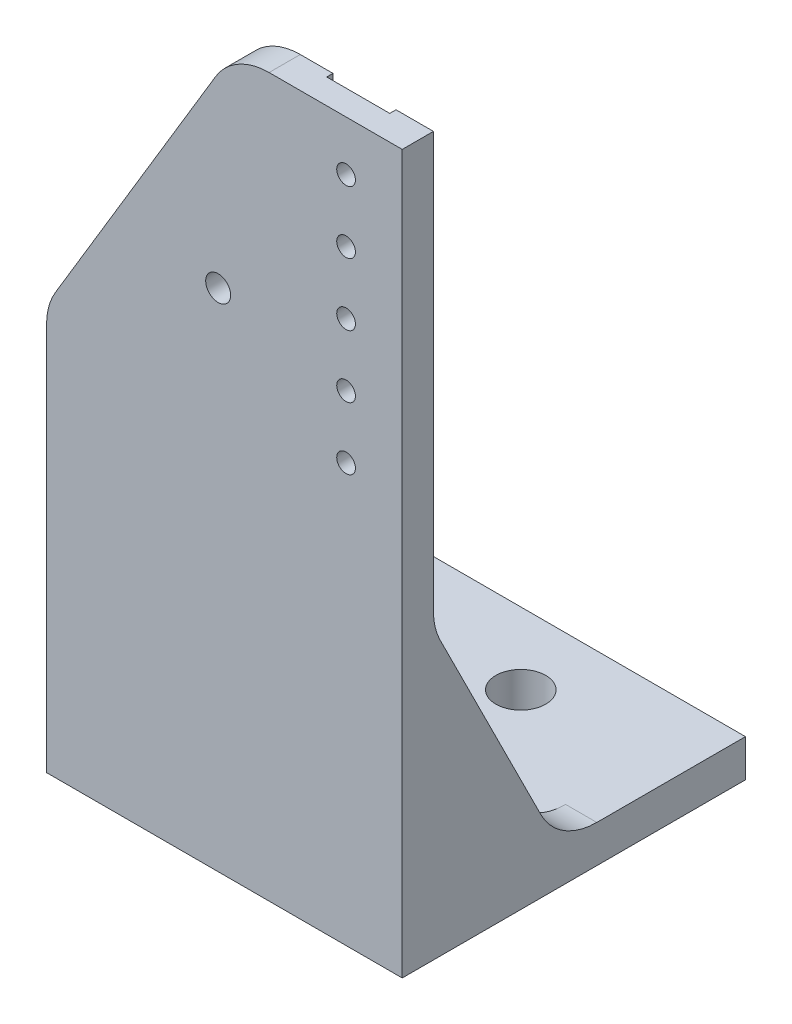
ISO-10303-21;
HEADER;
FILE_DESCRIPTION(('STEP AP214'),'2;1');
FILE_NAME('part.step','',(''),(''),'','','');
FILE_SCHEMA(('AUTOMOTIVE_DESIGN { 1 0 10303 214 1 1 1 1 }'));
ENDSEC;
DATA;
#1=APPLICATION_CONTEXT('core data for automotive mechanical design processes');
#2=APPLICATION_PROTOCOL_DEFINITION('international standard','automotive_design',2000,#1);
#3=PRODUCT_CONTEXT('',#1,'mechanical');
#4=PRODUCT('Part','Part','',(#3));
#5=PRODUCT_RELATED_PRODUCT_CATEGORY('part','',(#4));
#6=PRODUCT_DEFINITION_FORMATION('','',#4);
#7=PRODUCT_DEFINITION_CONTEXT('part definition',#1,'design');
#8=PRODUCT_DEFINITION('design','',#6,#7);
#9=PRODUCT_DEFINITION_SHAPE('','',#8);
#10=(LENGTH_UNIT() NAMED_UNIT(*) SI_UNIT(.MILLI.,.METRE.));
#11=(NAMED_UNIT(*) PLANE_ANGLE_UNIT() SI_UNIT($,.RADIAN.));
#12=(NAMED_UNIT(*) SI_UNIT($,.STERADIAN.) SOLID_ANGLE_UNIT());
#13=UNCERTAINTY_MEASURE_WITH_UNIT(LENGTH_MEASURE(1.E-05),#10,'distance_accuracy_value','');
#14=(GEOMETRIC_REPRESENTATION_CONTEXT(3) GLOBAL_UNCERTAINTY_ASSIGNED_CONTEXT((#13)) GLOBAL_UNIT_ASSIGNED_CONTEXT((#10,
#11,#12)) REPRESENTATION_CONTEXT('',''));
#15=CARTESIAN_POINT('',(0.,0.,0.));
#16=DIRECTION('',(0.,0.,1.));
#17=DIRECTION('',(1.,0.,0.));
#18=AXIS2_PLACEMENT_3D('',#15,#16,#17);
#19=CARTESIAN_POINT('',(0.,115.,25.));
#20=DIRECTION('',(0.,1.,0.));
#21=DIRECTION('',(-1.,0.,0.));
#22=AXIS2_PLACEMENT_3D('',#19,#20,#21);
#23=PLANE('',#22);
#24=DIRECTION('',(1.,0.,0.));
#25=VECTOR('',#24,1.);
#26=CARTESIAN_POINT('',(0.,115.,20.));
#27=LINE('',#26,#25);
#28=CARTESIAN_POINT('',(15.6619037896907,115.,20.));
#29=VERTEX_POINT('',#28);
#30=CARTESIAN_POINT('',(20.9,115.,20.));
#31=VERTEX_POINT('',#30);
#32=EDGE_CURVE('E278',#29,#31,#27,.T.);
#33=ORIENTED_EDGE('',*,*,#32,.F.);
#34=DIRECTION('',(0.,0.,1.));
#35=VECTOR('',#34,1.);
#36=CARTESIAN_POINT('',(15.6619037896907,115.,25.));
#37=LINE('',#36,#35);
#38=CARTESIAN_POINT('',(15.6619037896907,115.,25.));
#39=VERTEX_POINT('',#38);
#40=EDGE_CURVE('E349',#29,#39,#37,.T.);
#41=ORIENTED_EDGE('',*,*,#40,.T.);
#42=DIRECTION('',(1.,0.,0.));
#43=VECTOR('',#42,1.);
#44=CARTESIAN_POINT('',(0.,115.,25.));
#45=LINE('',#44,#43);
#46=CARTESIAN_POINT('',(37.,115.,25.));
#47=VERTEX_POINT('',#46);
#48=EDGE_CURVE('E269',#39,#47,#45,.T.);
#49=ORIENTED_EDGE('',*,*,#48,.T.);
#50=DIRECTION('',(0.,0.,-1.));
#51=VECTOR('',#50,1.);
#52=CARTESIAN_POINT('',(37.,115.,25.));
#53=LINE('',#52,#51);
#54=CARTESIAN_POINT('',(37.,115.,20.));
#55=VERTEX_POINT('',#54);
#56=EDGE_CURVE('E409',#47,#55,#53,.T.);
#57=ORIENTED_EDGE('',*,*,#56,.T.);
#58=CARTESIAN_POINT('',(31.,115.,20.));
#59=VERTEX_POINT('',#58);
#60=EDGE_CURVE('E277',#59,#55,#27,.T.);
#61=ORIENTED_EDGE('',*,*,#60,.F.);
#62=DIRECTION('',(0.,0.,-1.));
#63=VECTOR('',#62,1.);
#64=CARTESIAN_POINT('',(31.,115.,21.));
#65=LINE('',#64,#63);
#66=CARTESIAN_POINT('',(31.,115.,21.));
#67=VERTEX_POINT('',#66);
#68=EDGE_CURVE('E252',#67,#59,#65,.T.);
#69=ORIENTED_EDGE('',*,*,#68,.F.);
#70=DIRECTION('',(1.,0.,0.));
#71=VECTOR('',#70,1.);
#72=CARTESIAN_POINT('',(0.,115.,21.));
#73=LINE('',#72,#71);
#74=CARTESIAN_POINT('',(20.9,115.,21.));
#75=VERTEX_POINT('',#74);
#76=EDGE_CURVE('E231',#75,#67,#73,.T.);
#77=ORIENTED_EDGE('',*,*,#76,.F.);
#78=DIRECTION('',(0.,0.,-1.));
#79=VECTOR('',#78,1.);
#80=CARTESIAN_POINT('',(20.9,115.,21.));
#81=LINE('',#80,#79);
#82=EDGE_CURVE('E254',#75,#31,#81,.T.);
#83=ORIENTED_EDGE('',*,*,#82,.T.);
#84=EDGE_LOOP('',(#33,#41,#49,#57,#61,#69,#77,#83));
#85=FACE_BOUND('',#84,.T.);
#86=ADVANCED_FACE('F41',(#85),#23,.T.);
#87=CARTESIAN_POINT('',(0.,0.,20.));
#88=DIRECTION('',(0.,0.,1.));
#89=DIRECTION('',(1.,0.,0.));
#90=AXIS2_PLACEMENT_3D('',#87,#88,#89);
#91=PLANE('',#90);
#92=CARTESIAN_POINT('',(7.50000000000001,81.,20.));
#93=DIRECTION('',(0.,0.,1.));
#94=DIRECTION('',(1.,0.,0.));
#95=AXIS2_PLACEMENT_3D('',#92,#93,#94);
#96=CIRCLE('',#95,2.);
#97=CARTESIAN_POINT('',(9.50000000000001,81.,20.));
#98=VERTEX_POINT('',#97);
#99=EDGE_CURVE('E266',#98,#98,#96,.T.);
#100=ORIENTED_EDGE('',*,*,#99,.T.);
#101=EDGE_LOOP('',(#100));
#102=FACE_BOUND('',#101,.T.);
#103=DIRECTION('',(0.,1.,0.));
#104=VECTOR('',#103,1.);
#105=CARTESIAN_POINT('',(37.,0.,20.));
#106=LINE('',#105,#104);
#107=CARTESIAN_POINT('',(37.,48.3606797749979,20.));
#108=VERTEX_POINT('',#107);
#109=EDGE_CURVE('E192',#108,#55,#106,.T.);
#110=ORIENTED_EDGE('',*,*,#109,.F.);
#111=DIRECTION('',(1.,0.,0.));
#112=VECTOR('',#111,1.);
#113=CARTESIAN_POINT('',(0.,48.3606797749979,20.));
#114=LINE('',#113,#112);
#115=CARTESIAN_POINT('',(32.,48.3606797749979,20.));
#116=VERTEX_POINT('',#115);
#117=EDGE_CURVE('E358',#108,#116,#114,.F.);
#118=ORIENTED_EDGE('',*,*,#117,.T.);
#119=DIRECTION('',(0.,-1.,0.));
#120=VECTOR('',#119,1.);
#121=CARTESIAN_POINT('',(32.,6.,20.));
#122=LINE('',#121,#120);
#123=CARTESIAN_POINT('',(32.,6.,20.));
#124=VERTEX_POINT('',#123);
#125=EDGE_CURVE('E55',#116,#124,#122,.T.);
#126=ORIENTED_EDGE('',*,*,#125,.T.);
#127=DIRECTION('',(1.,0.,0.));
#128=VECTOR('',#127,1.);
#129=CARTESIAN_POINT('',(0.,6.,20.));
#130=LINE('',#129,#128);
#131=CARTESIAN_POINT('',(-20.,6.,20.));
#132=VERTEX_POINT('',#131);
#133=EDGE_CURVE('E203',#132,#124,#130,.T.);
#134=ORIENTED_EDGE('',*,*,#133,.F.);
#135=DIRECTION('',(0.,1.,0.));
#136=VECTOR('',#135,1.);
#137=CARTESIAN_POINT('',(-20.,0.,20.));
#138=LINE('',#137,#136);
#139=CARTESIAN_POINT('',(-20.,62.2301603505154,20.));
#140=VERTEX_POINT('',#139);
#141=EDGE_CURVE('E261',#132,#140,#138,.T.);
#142=ORIENTED_EDGE('',*,*,#141,.T.);
#143=CARTESIAN_POINT('',(-9.99999999999999,62.2301603505154,20.));
#144=DIRECTION('',(0.,0.,1.));
#145=DIRECTION('',(1.,0.,0.));
#146=AXIS2_PLACEMENT_3D('',#143,#144,#145);
#147=CIRCLE('',#146,10.);
#148=CARTESIAN_POINT('',(-18.5749292571254,67.3751179047907,20.));
#149=VERTEX_POINT('',#148);
#150=EDGE_CURVE('E339',#140,#149,#147,.F.);
#151=ORIENTED_EDGE('',*,*,#150,.T.);
#152=DIRECTION('',(0.514495755427525,0.857492925712545,0.));
#153=VECTOR('',#152,1.);
#154=CARTESIAN_POINT('',(-20.,64.9999999999997,20.));
#155=LINE('',#154,#153);
#156=CARTESIAN_POINT('',(7.08697453256523,110.144957554275,20.));
#157=VERTEX_POINT('',#156);
#158=EDGE_CURVE('E202',#149,#157,#155,.T.);
#159=ORIENTED_EDGE('',*,*,#158,.T.);
#160=CARTESIAN_POINT('',(15.6619037896907,105.,20.));
#161=DIRECTION('',(0.,0.,1.));
#162=DIRECTION('',(1.,0.,0.));
#163=AXIS2_PLACEMENT_3D('',#160,#161,#162);
#164=CIRCLE('',#163,10.);
#165=EDGE_CURVE('E337',#157,#29,#164,.F.);
#166=ORIENTED_EDGE('',*,*,#165,.T.);
#167=ORIENTED_EDGE('',*,*,#32,.T.);
#168=DIRECTION('',(0.,-1.,0.));
#169=VECTOR('',#168,1.);
#170=CARTESIAN_POINT('',(20.9,0.,20.));
#171=LINE('',#170,#169);
#172=CARTESIAN_POINT('',(20.9,60.,20.));
#173=VERTEX_POINT('',#172);
#174=EDGE_CURVE('E243',#31,#173,#171,.T.);
#175=ORIENTED_EDGE('',*,*,#174,.T.);
#176=DIRECTION('',(1.,0.,0.));
#177=VECTOR('',#176,1.);
#178=CARTESIAN_POINT('',(0.,60.,20.));
#179=LINE('',#178,#177);
#180=CARTESIAN_POINT('',(31.,60.,20.));
#181=VERTEX_POINT('',#180);
#182=EDGE_CURVE('E240',#173,#181,#179,.T.);
#183=ORIENTED_EDGE('',*,*,#182,.T.);
#184=DIRECTION('',(0.,1.,0.));
#185=VECTOR('',#184,1.);
#186=CARTESIAN_POINT('',(31.,0.,20.));
#187=LINE('',#186,#185);
#188=EDGE_CURVE('E229',#181,#59,#187,.T.);
#189=ORIENTED_EDGE('',*,*,#188,.T.);
#190=ORIENTED_EDGE('',*,*,#60,.T.);
#191=EDGE_LOOP('',(#110,#118,#126,#134,#142,#151,#159,#166,#167,#175,#183,#189,#190));
#192=FACE_BOUND('',#191,.T.);
#193=ADVANCED_FACE('F424',(#102,#192),#91,.F.);
#194=CARTESIAN_POINT('',(0.,6.,0.));
#195=DIRECTION('',(0.,1.,0.));
#196=DIRECTION('',(0.,0.,1.));
#197=AXIS2_PLACEMENT_3D('',#194,#195,#196);
#198=PLANE('',#197);
#199=DIRECTION('',(0.,0.,-1.));
#200=VECTOR('',#199,1.);
#201=CARTESIAN_POINT('',(32.,6.,20.));
#202=LINE('',#201,#200);
#203=CARTESIAN_POINT('',(32.,6.,-6.18033988749895));
#204=VERTEX_POINT('',#203);
#205=EDGE_CURVE('E367',#124,#204,#202,.T.);
#206=ORIENTED_EDGE('',*,*,#205,.T.);
#207=DIRECTION('',(1.,0.,0.));
#208=VECTOR('',#207,1.);
#209=CARTESIAN_POINT('',(37.,6.,-6.18033988749894));
#210=LINE('',#209,#208);
#211=CARTESIAN_POINT('',(37.,6.,-6.18033988749894));
#212=VERTEX_POINT('',#211);
#213=EDGE_CURVE('E191',#204,#212,#210,.T.);
#214=ORIENTED_EDGE('',*,*,#213,.T.);
#215=DIRECTION('',(0.,0.,-1.));
#216=VECTOR('',#215,1.);
#217=CARTESIAN_POINT('',(37.,6.,0.));
#218=LINE('',#217,#216);
#219=CARTESIAN_POINT('',(37.,6.,-30.));
#220=VERTEX_POINT('',#219);
#221=EDGE_CURVE('E183',#212,#220,#218,.T.);
#222=ORIENTED_EDGE('',*,*,#221,.T.);
#223=DIRECTION('',(1.,0.,0.));
#224=VECTOR('',#223,1.);
#225=CARTESIAN_POINT('',(-20.,6.,-30.));
#226=LINE('',#225,#224);
#227=CARTESIAN_POINT('',(-20.,6.,-30.));
#228=VERTEX_POINT('',#227);
#229=EDGE_CURVE('E189',#228,#220,#226,.T.);
#230=ORIENTED_EDGE('',*,*,#229,.F.);
#231=DIRECTION('',(0.,0.,1.));
#232=VECTOR('',#231,1.);
#233=CARTESIAN_POINT('',(-20.,6.,0.));
#234=LINE('',#233,#232);
#235=EDGE_CURVE('E322',#228,#132,#234,.T.);
#236=ORIENTED_EDGE('',*,*,#235,.T.);
#237=ORIENTED_EDGE('',*,*,#133,.T.);
#238=EDGE_LOOP('',(#206,#214,#222,#230,#236,#237));
#239=FACE_BOUND('',#238,.T.);
#240=CARTESIAN_POINT('',(12.5,6.,-18.5));
#241=DIRECTION('',(0.,1.,0.));
#242=DIRECTION('',(0.,0.,1.));
#243=AXIS2_PLACEMENT_3D('',#240,#241,#242);
#244=CIRCLE('',#243,4.);
#245=CARTESIAN_POINT('',(12.5,6.,-14.5));
#246=VERTEX_POINT('',#245);
#247=EDGE_CURVE('E216',#246,#246,#244,.T.);
#248=ORIENTED_EDGE('',*,*,#247,.F.);
#249=EDGE_LOOP('',(#248));
#250=FACE_BOUND('',#249,.T.);
#251=CARTESIAN_POINT('',(-12.5,6.,6.5));
#252=DIRECTION('',(0.,1.,0.));
#253=DIRECTION('',(0.,0.,1.));
#254=AXIS2_PLACEMENT_3D('',#251,#252,#253);
#255=CIRCLE('',#254,4.);
#256=CARTESIAN_POINT('',(-12.5,6.,10.5));
#257=VERTEX_POINT('',#256);
#258=EDGE_CURVE('E309',#257,#257,#255,.T.);
#259=ORIENTED_EDGE('',*,*,#258,.F.);
#260=EDGE_LOOP('',(#259));
#261=FACE_BOUND('',#260,.T.);
#262=DIRECTION('',(-1.,0.,0.));
#263=VECTOR('',#262,1.);
#264=CARTESIAN_POINT('',(0.,6.,19.));
#265=LINE('',#264,#263);
#266=CARTESIAN_POINT('',(21.5,6.,19.));
#267=VERTEX_POINT('',#266);
#268=CARTESIAN_POINT('',(6.5,6.,19.));
#269=VERTEX_POINT('',#268);
#270=EDGE_CURVE('E298',#267,#269,#265,.T.);
#271=ORIENTED_EDGE('',*,*,#270,.T.);
#272=DIRECTION('',(0.,0.,-1.));
#273=VECTOR('',#272,1.);
#274=CARTESIAN_POINT('',(6.5,6.,0.));
#275=LINE('',#274,#273);
#276=CARTESIAN_POINT('',(6.5,6.,-7.));
#277=VERTEX_POINT('',#276);
#278=EDGE_CURVE('E274',#269,#277,#275,.T.);
#279=ORIENTED_EDGE('',*,*,#278,.T.);
#280=DIRECTION('',(1.,0.,0.));
#281=VECTOR('',#280,1.);
#282=CARTESIAN_POINT('',(0.,6.,-7.));
#283=LINE('',#282,#281);
#284=CARTESIAN_POINT('',(21.5,6.,-7.));
#285=VERTEX_POINT('',#284);
#286=EDGE_CURVE('E286',#277,#285,#283,.T.);
#287=ORIENTED_EDGE('',*,*,#286,.T.);
#288=DIRECTION('',(0.,0.,1.));
#289=VECTOR('',#288,1.);
#290=CARTESIAN_POINT('',(21.5,6.,0.));
#291=LINE('',#290,#289);
#292=EDGE_CURVE('E301',#285,#267,#291,.T.);
#293=ORIENTED_EDGE('',*,*,#292,.T.);
#294=EDGE_LOOP('',(#271,#279,#287,#293));
#295=FACE_BOUND('',#294,.T.);
#296=ADVANCED_FACE('F185',(#239,#250,#261,#295),#198,.T.);
#297=CARTESIAN_POINT('',(0.,0.,0.));
#298=DIRECTION('',(0.,1.,0.));
#299=DIRECTION('',(0.,0.,1.));
#300=AXIS2_PLACEMENT_3D('',#297,#298,#299);
#301=PLANE('',#300);
#302=CARTESIAN_POINT('',(-12.5,0.,6.5));
#303=DIRECTION('',(0.,1.,0.));
#304=DIRECTION('',(0.,0.,1.));
#305=AXIS2_PLACEMENT_3D('',#302,#303,#304);
#306=CIRCLE('',#305,4.);
#307=CARTESIAN_POINT('',(-12.5,0.,10.5));
#308=VERTEX_POINT('',#307);
#309=EDGE_CURVE('E316',#308,#308,#306,.T.);
#310=ORIENTED_EDGE('',*,*,#309,.T.);
#311=EDGE_LOOP('',(#310));
#312=FACE_BOUND('',#311,.T.);
#313=CARTESIAN_POINT('',(12.5,0.,6.5));
#314=DIRECTION('',(0.,-1.,0.));
#315=DIRECTION('',(0.,0.,-1.));
#316=AXIS2_PLACEMENT_3D('',#313,#314,#315);
#317=CIRCLE('',#316,6.);
#318=CARTESIAN_POINT('',(12.5,0.,0.500000000000007));
#319=VERTEX_POINT('',#318);
#320=EDGE_CURVE('E211',#319,#319,#317,.T.);
#321=ORIENTED_EDGE('',*,*,#320,.F.);
#322=EDGE_LOOP('',(#321));
#323=FACE_BOUND('',#322,.T.);
#324=CARTESIAN_POINT('',(12.5,0.,-18.5));
#325=DIRECTION('',(0.,1.,0.));
#326=DIRECTION('',(0.,0.,1.));
#327=AXIS2_PLACEMENT_3D('',#324,#325,#326);
#328=CIRCLE('',#327,4.);
#329=CARTESIAN_POINT('',(12.5,0.,-14.5));
#330=VERTEX_POINT('',#329);
#331=EDGE_CURVE('E213',#330,#330,#328,.T.);
#332=ORIENTED_EDGE('',*,*,#331,.T.);
#333=EDGE_LOOP('',(#332));
#334=FACE_BOUND('',#333,.T.);
#335=DIRECTION('',(0.,0.,-1.));
#336=VECTOR('',#335,1.);
#337=CARTESIAN_POINT('',(37.,0.,0.));
#338=LINE('',#337,#336);
#339=CARTESIAN_POINT('',(37.,0.,25.));
#340=VERTEX_POINT('',#339);
#341=CARTESIAN_POINT('',(37.,0.,-30.));
#342=VERTEX_POINT('',#341);
#343=EDGE_CURVE('E193',#340,#342,#338,.T.);
#344=ORIENTED_EDGE('',*,*,#343,.F.);
#345=DIRECTION('',(1.,0.,0.));
#346=VECTOR('',#345,1.);
#347=CARTESIAN_POINT('',(0.,0.,25.));
#348=LINE('',#347,#346);
#349=CARTESIAN_POINT('',(-20.,0.,25.));
#350=VERTEX_POINT('',#349);
#351=EDGE_CURVE('E265',#350,#340,#348,.T.);
#352=ORIENTED_EDGE('',*,*,#351,.F.);
#353=DIRECTION('',(0.,0.,1.));
#354=VECTOR('',#353,1.);
#355=CARTESIAN_POINT('',(-20.,0.,0.));
#356=LINE('',#355,#354);
#357=CARTESIAN_POINT('',(-20.,0.,-30.));
#358=VERTEX_POINT('',#357);
#359=EDGE_CURVE('E319',#358,#350,#356,.T.);
#360=ORIENTED_EDGE('',*,*,#359,.F.);
#361=DIRECTION('',(1.,0.,0.));
#362=VECTOR('',#361,1.);
#363=CARTESIAN_POINT('',(-20.,0.,-30.));
#364=LINE('',#363,#362);
#365=EDGE_CURVE('E209',#358,#342,#364,.T.);
#366=ORIENTED_EDGE('',*,*,#365,.T.);
#367=EDGE_LOOP('',(#344,#352,#360,#366));
#368=FACE_BOUND('',#367,.T.);
#369=ADVANCED_FACE('F423',(#312,#323,#334,#368),#301,.F.);
#370=CARTESIAN_POINT('',(0.,0.,25.));
#371=DIRECTION('',(0.,0.,1.));
#372=DIRECTION('',(1.,0.,0.));
#373=AXIS2_PLACEMENT_3D('',#370,#371,#372);
#374=PLANE('',#373);
#375=CARTESIAN_POINT('',(28.,67.,25.));
#376=DIRECTION('',(0.,0.,-1.));
#377=DIRECTION('',(-1.,0.,0.));
#378=AXIS2_PLACEMENT_3D('',#375,#376,#377);
#379=CIRCLE('',#378,1.5);
#380=CARTESIAN_POINT('',(26.5,67.,25.));
#381=VERTEX_POINT('',#380);
#382=EDGE_CURVE('E390',#381,#381,#379,.T.);
#383=ORIENTED_EDGE('',*,*,#382,.T.);
#384=EDGE_LOOP('',(#383));
#385=FACE_BOUND('',#384,.T.);
#386=CARTESIAN_POINT('',(28.,97.,25.));
#387=DIRECTION('',(0.,0.,-1.));
#388=DIRECTION('',(-1.,0.,0.));
#389=AXIS2_PLACEMENT_3D('',#386,#387,#388);
#390=CIRCLE('',#389,1.5);
#391=CARTESIAN_POINT('',(26.5,97.,25.));
#392=VERTEX_POINT('',#391);
#393=EDGE_CURVE('E389',#392,#392,#390,.T.);
#394=ORIENTED_EDGE('',*,*,#393,.T.);
#395=EDGE_LOOP('',(#394));
#396=FACE_BOUND('',#395,.T.);
#397=CARTESIAN_POINT('',(28.,107.,25.));
#398=DIRECTION('',(0.,0.,-1.));
#399=DIRECTION('',(-1.,0.,0.));
#400=AXIS2_PLACEMENT_3D('',#397,#398,#399);
#401=CIRCLE('',#400,1.5);
#402=CARTESIAN_POINT('',(26.5,107.,25.));
#403=VERTEX_POINT('',#402);
#404=EDGE_CURVE('E383',#403,#403,#401,.T.);
#405=ORIENTED_EDGE('',*,*,#404,.T.);
#406=EDGE_LOOP('',(#405));
#407=FACE_BOUND('',#406,.T.);
#408=CARTESIAN_POINT('',(28.,77.,25.));
#409=DIRECTION('',(0.,0.,-1.));
#410=DIRECTION('',(-1.,0.,0.));
#411=AXIS2_PLACEMENT_3D('',#408,#409,#410);
#412=CIRCLE('',#411,1.5);
#413=CARTESIAN_POINT('',(26.5,77.,25.));
#414=VERTEX_POINT('',#413);
#415=EDGE_CURVE('E397',#414,#414,#412,.T.);
#416=ORIENTED_EDGE('',*,*,#415,.T.);
#417=EDGE_LOOP('',(#416));
#418=FACE_BOUND('',#417,.T.);
#419=CARTESIAN_POINT('',(28.,87.,25.));
#420=DIRECTION('',(0.,0.,-1.));
#421=DIRECTION('',(-1.,0.,0.));
#422=AXIS2_PLACEMENT_3D('',#419,#420,#421);
#423=CIRCLE('',#422,1.5);
#424=CARTESIAN_POINT('',(26.5,87.,25.));
#425=VERTEX_POINT('',#424);
#426=EDGE_CURVE('E251',#425,#425,#423,.T.);
#427=ORIENTED_EDGE('',*,*,#426,.T.);
#428=EDGE_LOOP('',(#427));
#429=FACE_BOUND('',#428,.T.);
#430=CARTESIAN_POINT('',(7.50000000000001,81.,25.));
#431=DIRECTION('',(0.,0.,1.));
#432=DIRECTION('',(1.,0.,0.));
#433=AXIS2_PLACEMENT_3D('',#430,#431,#432);
#434=CIRCLE('',#433,2.);
#435=CARTESIAN_POINT('',(9.50000000000001,81.,25.));
#436=VERTEX_POINT('',#435);
#437=EDGE_CURVE('E271',#436,#436,#434,.T.);
#438=ORIENTED_EDGE('',*,*,#437,.F.);
#439=EDGE_LOOP('',(#438));
#440=FACE_BOUND('',#439,.T.);
#441=DIRECTION('',(-0.514495755427525,-0.857492925712545,0.));
#442=VECTOR('',#441,1.);
#443=CARTESIAN_POINT('',(-43.3823529411763,26.0294117647057,25.));
#444=LINE('',#443,#442);
#445=CARTESIAN_POINT('',(7.08697453256524,110.144957554275,25.));
#446=VERTEX_POINT('',#445);
#447=CARTESIAN_POINT('',(-18.5749292571254,67.3751179047906,25.));
#448=VERTEX_POINT('',#447);
#449=EDGE_CURVE('E331',#446,#448,#444,.T.);
#450=ORIENTED_EDGE('',*,*,#449,.T.);
#451=CARTESIAN_POINT('',(-9.99999999999999,62.2301603505154,25.));
#452=DIRECTION('',(0.,0.,1.));
#453=DIRECTION('',(1.,0.,0.));
#454=AXIS2_PLACEMENT_3D('',#451,#452,#453);
#455=CIRCLE('',#454,10.);
#456=CARTESIAN_POINT('',(-20.,62.2301603505154,25.));
#457=VERTEX_POINT('',#456);
#458=EDGE_CURVE('E347',#448,#457,#455,.T.);
#459=ORIENTED_EDGE('',*,*,#458,.T.);
#460=DIRECTION('',(0.,1.,0.));
#461=VECTOR('',#460,1.);
#462=CARTESIAN_POINT('',(-20.,0.,25.));
#463=LINE('',#462,#461);
#464=EDGE_CURVE('E262',#350,#457,#463,.T.);
#465=ORIENTED_EDGE('',*,*,#464,.F.);
#466=ORIENTED_EDGE('',*,*,#351,.T.);
#467=DIRECTION('',(0.,1.,0.));
#468=VECTOR('',#467,1.);
#469=CARTESIAN_POINT('',(37.,0.,25.));
#470=LINE('',#469,#468);
#471=EDGE_CURVE('E412',#340,#47,#470,.T.);
#472=ORIENTED_EDGE('',*,*,#471,.T.);
#473=ORIENTED_EDGE('',*,*,#48,.F.);
#474=CARTESIAN_POINT('',(15.6619037896907,105.,25.));
#475=DIRECTION('',(0.,0.,1.));
#476=DIRECTION('',(1.,0.,0.));
#477=AXIS2_PLACEMENT_3D('',#474,#475,#476);
#478=CIRCLE('',#477,10.);
#479=EDGE_CURVE('E345',#39,#446,#478,.T.);
#480=ORIENTED_EDGE('',*,*,#479,.T.);
#481=EDGE_LOOP('',(#450,#459,#465,#466,#472,#473,#480));
#482=FACE_BOUND('',#481,.T.);
#483=ADVANCED_FACE('F523',(#385,#396,#407,#418,#429,#440,#482),#374,.T.);
#484=CARTESIAN_POINT('',(-20.,6.,-30.));
#485=DIRECTION('',(0.,0.,-1.));
#486=DIRECTION('',(-1.,0.,0.));
#487=AXIS2_PLACEMENT_3D('',#484,#485,#486);
#488=PLANE('',#487);
#489=ORIENTED_EDGE('',*,*,#229,.T.);
#490=DIRECTION('',(0.,-1.,0.));
#491=VECTOR('',#490,1.);
#492=CARTESIAN_POINT('',(37.,6.,-30.));
#493=LINE('',#492,#491);
#494=EDGE_CURVE('E196',#220,#342,#493,.T.);
#495=ORIENTED_EDGE('',*,*,#494,.T.);
#496=ORIENTED_EDGE('',*,*,#365,.F.);
#497=DIRECTION('',(0.,-1.,0.));
#498=VECTOR('',#497,1.);
#499=CARTESIAN_POINT('',(-20.,6.,-30.));
#500=LINE('',#499,#498);
#501=EDGE_CURVE('E208',#228,#358,#500,.T.);
#502=ORIENTED_EDGE('',*,*,#501,.F.);
#503=EDGE_LOOP('',(#489,#495,#496,#502));
#504=FACE_BOUND('',#503,.T.);
#505=ADVANCED_FACE('F206',(#504),#488,.T.);
#506=CARTESIAN_POINT('',(12.5,0.,6.5));
#507=DIRECTION('',(0.,1.,0.));
#508=DIRECTION('',(0.,0.,1.));
#509=AXIS2_PLACEMENT_3D('',#506,#507,#508);
#510=CYLINDRICAL_SURFACE('',#509,3.);
#511=CARTESIAN_POINT('',(12.5,5.,6.5));
#512=DIRECTION('',(0.,1.,0.));
#513=DIRECTION('',(0.,0.,1.));
#514=AXIS2_PLACEMENT_3D('',#511,#512,#513);
#515=CIRCLE('',#514,3.);
#516=CARTESIAN_POINT('',(12.5,5.,9.5));
#517=VERTEX_POINT('',#516);
#518=EDGE_CURVE('E292',#517,#517,#515,.F.);
#519=ORIENTED_EDGE('',*,*,#518,.F.);
#520=EDGE_LOOP('',(#519));
#521=FACE_BOUND('',#520,.T.);
#522=CARTESIAN_POINT('',(12.5,2.,6.5));
#523=DIRECTION('',(0.,-1.,0.));
#524=DIRECTION('',(0.,0.,-1.));
#525=AXIS2_PLACEMENT_3D('',#522,#523,#524);
#526=CIRCLE('',#525,3.);
#527=CARTESIAN_POINT('',(12.5,2.,3.5));
#528=VERTEX_POINT('',#527);
#529=EDGE_CURVE('E222',#528,#528,#526,.F.);
#530=ORIENTED_EDGE('',*,*,#529,.F.);
#531=EDGE_LOOP('',(#530));
#532=FACE_BOUND('',#531,.T.);
#533=ADVANCED_FACE('F584',(#521,#532),#510,.F.);
#534=CARTESIAN_POINT('',(28.,87.,25.));
#535=DIRECTION('',(0.,0.,-1.));
#536=DIRECTION('',(-1.,0.,0.));
#537=AXIS2_PLACEMENT_3D('',#534,#535,#536);
#538=CYLINDRICAL_SURFACE('',#537,1.5);
#539=ORIENTED_EDGE('',*,*,#426,.F.);
#540=EDGE_LOOP('',(#539));
#541=FACE_BOUND('',#540,.T.);
#542=CARTESIAN_POINT('',(28.,87.,21.));
#543=DIRECTION('',(0.,0.,-1.));
#544=DIRECTION('',(-1.,0.,0.));
#545=AXIS2_PLACEMENT_3D('',#542,#543,#544);
#546=CIRCLE('',#545,1.5);
#547=CARTESIAN_POINT('',(26.5,87.,21.));
#548=VERTEX_POINT('',#547);
#549=EDGE_CURVE('E236',#548,#548,#546,.F.);
#550=ORIENTED_EDGE('',*,*,#549,.F.);
#551=EDGE_LOOP('',(#550));
#552=FACE_BOUND('',#551,.T.);
#553=ADVANCED_FACE('F540',(#541,#552),#538,.F.);
#554=CARTESIAN_POINT('',(-20.,6.,0.));
#555=DIRECTION('',(1.,0.,0.));
#556=DIRECTION('',(0.,0.,-1.));
#557=AXIS2_PLACEMENT_3D('',#554,#555,#556);
#558=PLANE('',#557);
#559=ORIENTED_EDGE('',*,*,#464,.T.);
#560=DIRECTION('',(0.,0.,-1.));
#561=VECTOR('',#560,1.);
#562=CARTESIAN_POINT('',(-20.,62.2301603505154,20.));
#563=LINE('',#562,#561);
#564=EDGE_CURVE('E334',#457,#140,#563,.T.);
#565=ORIENTED_EDGE('',*,*,#564,.T.);
#566=ORIENTED_EDGE('',*,*,#141,.F.);
#567=ORIENTED_EDGE('',*,*,#235,.F.);
#568=ORIENTED_EDGE('',*,*,#501,.T.);
#569=ORIENTED_EDGE('',*,*,#359,.T.);
#570=EDGE_LOOP('',(#559,#565,#566,#567,#568,#569));
#571=FACE_BOUND('',#570,.T.);
#572=ADVANCED_FACE('F492',(#571),#558,.F.);
#573=CARTESIAN_POINT('',(-12.5,0.,6.5));
#574=DIRECTION('',(0.,1.,0.));
#575=DIRECTION('',(0.,0.,1.));
#576=AXIS2_PLACEMENT_3D('',#573,#574,#575);
#577=CYLINDRICAL_SURFACE('',#576,4.);
#578=ORIENTED_EDGE('',*,*,#309,.F.);
#579=EDGE_LOOP('',(#578));
#580=FACE_BOUND('',#579,.T.);
#581=ORIENTED_EDGE('',*,*,#258,.T.);
#582=EDGE_LOOP('',(#581));
#583=FACE_BOUND('',#582,.T.);
#584=ADVANCED_FACE('F539',(#580,#583),#577,.F.);
#585=CARTESIAN_POINT('',(6.5,5.,0.));
#586=DIRECTION('',(1.,0.,0.));
#587=DIRECTION('',(0.,0.,-1.));
#588=AXIS2_PLACEMENT_3D('',#585,#586,#587);
#589=PLANE('',#588);
#590=ORIENTED_EDGE('',*,*,#278,.F.);
#591=DIRECTION('',(0.,1.,0.));
#592=VECTOR('',#591,1.);
#593=CARTESIAN_POINT('',(6.5,5.,19.));
#594=LINE('',#593,#592);
#595=CARTESIAN_POINT('',(6.5,5.,19.));
#596=VERTEX_POINT('',#595);
#597=EDGE_CURVE('E295',#596,#269,#594,.T.);
#598=ORIENTED_EDGE('',*,*,#597,.F.);
#599=DIRECTION('',(0.,0.,-1.));
#600=VECTOR('',#599,1.);
#601=CARTESIAN_POINT('',(6.5,5.,0.));
#602=LINE('',#601,#600);
#603=CARTESIAN_POINT('',(6.5,5.,-7.));
#604=VERTEX_POINT('',#603);
#605=EDGE_CURVE('E282',#596,#604,#602,.T.);
#606=ORIENTED_EDGE('',*,*,#605,.T.);
#607=DIRECTION('',(0.,1.,0.));
#608=VECTOR('',#607,1.);
#609=CARTESIAN_POINT('',(6.5,5.,-7.));
#610=LINE('',#609,#608);
#611=EDGE_CURVE('E306',#604,#277,#610,.T.);
#612=ORIENTED_EDGE('',*,*,#611,.T.);
#613=EDGE_LOOP('',(#590,#598,#606,#612));
#614=FACE_BOUND('',#613,.T.);
#615=ADVANCED_FACE('F437',(#614),#589,.T.);
#616=CARTESIAN_POINT('',(0.,5.,-7.));
#617=DIRECTION('',(0.,0.,1.));
#618=DIRECTION('',(1.,0.,0.));
#619=AXIS2_PLACEMENT_3D('',#616,#617,#618);
#620=PLANE('',#619);
#621=ORIENTED_EDGE('',*,*,#286,.F.);
#622=ORIENTED_EDGE('',*,*,#611,.F.);
#623=DIRECTION('',(1.,0.,0.));
#624=VECTOR('',#623,1.);
#625=CARTESIAN_POINT('',(0.,5.,-7.));
#626=LINE('',#625,#624);
#627=CARTESIAN_POINT('',(21.5,5.,-7.));
#628=VERTEX_POINT('',#627);
#629=EDGE_CURVE('E290',#604,#628,#626,.T.);
#630=ORIENTED_EDGE('',*,*,#629,.T.);
#631=DIRECTION('',(0.,1.,0.));
#632=VECTOR('',#631,1.);
#633=CARTESIAN_POINT('',(21.5,5.,-7.));
#634=LINE('',#633,#632);
#635=EDGE_CURVE('E310',#628,#285,#634,.T.);
#636=ORIENTED_EDGE('',*,*,#635,.T.);
#637=EDGE_LOOP('',(#621,#622,#630,#636));
#638=FACE_BOUND('',#637,.T.);
#639=ADVANCED_FACE('F445',(#638),#620,.T.);
#640=CARTESIAN_POINT('',(21.5,5.,0.));
#641=DIRECTION('',(-1.,0.,0.));
#642=DIRECTION('',(0.,0.,1.));
#643=AXIS2_PLACEMENT_3D('',#640,#641,#642);
#644=PLANE('',#643);
#645=ORIENTED_EDGE('',*,*,#292,.F.);
#646=ORIENTED_EDGE('',*,*,#635,.F.);
#647=DIRECTION('',(0.,0.,1.));
#648=VECTOR('',#647,1.);
#649=CARTESIAN_POINT('',(21.5,5.,0.));
#650=LINE('',#649,#648);
#651=CARTESIAN_POINT('',(21.5,5.,19.));
#652=VERTEX_POINT('',#651);
#653=EDGE_CURVE('E288',#628,#652,#650,.T.);
#654=ORIENTED_EDGE('',*,*,#653,.T.);
#655=DIRECTION('',(0.,1.,0.));
#656=VECTOR('',#655,1.);
#657=CARTESIAN_POINT('',(21.5,5.,19.));
#658=LINE('',#657,#656);
#659=EDGE_CURVE('E312',#652,#267,#658,.T.);
#660=ORIENTED_EDGE('',*,*,#659,.T.);
#661=EDGE_LOOP('',(#645,#646,#654,#660));
#662=FACE_BOUND('',#661,.T.);
#663=ADVANCED_FACE('F447',(#662),#644,.T.);
#664=CARTESIAN_POINT('',(0.,5.,19.));
#665=DIRECTION('',(0.,0.,-1.));
#666=DIRECTION('',(-1.,0.,0.));
#667=AXIS2_PLACEMENT_3D('',#664,#665,#666);
#668=PLANE('',#667);
#669=ORIENTED_EDGE('',*,*,#270,.F.);
#670=ORIENTED_EDGE('',*,*,#659,.F.);
#671=DIRECTION('',(-1.,0.,0.));
#672=VECTOR('',#671,1.);
#673=CARTESIAN_POINT('',(0.,5.,19.));
#674=LINE('',#673,#672);
#675=EDGE_CURVE('E285',#652,#596,#674,.T.);
#676=ORIENTED_EDGE('',*,*,#675,.T.);
#677=ORIENTED_EDGE('',*,*,#597,.T.);
#678=EDGE_LOOP('',(#669,#670,#676,#677));
#679=FACE_BOUND('',#678,.T.);
#680=ADVANCED_FACE('F432',(#679),#668,.T.);
#681=CARTESIAN_POINT('',(0.,5.,0.));
#682=DIRECTION('',(0.,1.,0.));
#683=DIRECTION('',(0.,0.,1.));
#684=AXIS2_PLACEMENT_3D('',#681,#682,#683);
#685=PLANE('',#684);
#686=ORIENTED_EDGE('',*,*,#605,.F.);
#687=ORIENTED_EDGE('',*,*,#675,.F.);
#688=ORIENTED_EDGE('',*,*,#653,.F.);
#689=ORIENTED_EDGE('',*,*,#629,.F.);
#690=EDGE_LOOP('',(#686,#687,#688,#689));
#691=FACE_BOUND('',#690,.T.);
#692=ORIENTED_EDGE('',*,*,#518,.T.);
#693=EDGE_LOOP('',(#692));
#694=FACE_BOUND('',#693,.T.);
#695=ADVANCED_FACE('F440',(#691,#694),#685,.T.);
#696=CARTESIAN_POINT('',(7.50000000000001,81.,25.));
#697=DIRECTION('',(0.,0.,-1.));
#698=DIRECTION('',(-1.,0.,0.));
#699=AXIS2_PLACEMENT_3D('',#696,#697,#698);
#700=CYLINDRICAL_SURFACE('',#699,2.);
#701=ORIENTED_EDGE('',*,*,#437,.T.);
#702=EDGE_LOOP('',(#701));
#703=FACE_BOUND('',#702,.T.);
#704=ORIENTED_EDGE('',*,*,#99,.F.);
#705=EDGE_LOOP('',(#704));
#706=FACE_BOUND('',#705,.T.);
#707=ADVANCED_FACE('F467',(#703,#706),#700,.F.);
#708=CARTESIAN_POINT('',(0.,60.,21.));
#709=DIRECTION('',(0.,1.,0.));
#710=DIRECTION('',(-1.,0.,0.));
#711=AXIS2_PLACEMENT_3D('',#708,#709,#710);
#712=PLANE('',#711);
#713=ORIENTED_EDGE('',*,*,#182,.F.);
#714=DIRECTION('',(0.,0.,-1.));
#715=VECTOR('',#714,1.);
#716=CARTESIAN_POINT('',(20.9,60.,21.));
#717=LINE('',#716,#715);
#718=CARTESIAN_POINT('',(20.9,60.,21.));
#719=VERTEX_POINT('',#718);
#720=EDGE_CURVE('E239',#719,#173,#717,.T.);
#721=ORIENTED_EDGE('',*,*,#720,.F.);
#722=DIRECTION('',(1.,0.,0.));
#723=VECTOR('',#722,1.);
#724=CARTESIAN_POINT('',(0.,60.,21.));
#725=LINE('',#724,#723);
#726=CARTESIAN_POINT('',(31.,60.,21.));
#727=VERTEX_POINT('',#726);
#728=EDGE_CURVE('E225',#719,#727,#725,.T.);
#729=ORIENTED_EDGE('',*,*,#728,.T.);
#730=DIRECTION('',(0.,0.,-1.));
#731=VECTOR('',#730,1.);
#732=CARTESIAN_POINT('',(31.,60.,21.));
#733=LINE('',#732,#731);
#734=EDGE_CURVE('E248',#727,#181,#733,.T.);
#735=ORIENTED_EDGE('',*,*,#734,.T.);
#736=EDGE_LOOP('',(#713,#721,#729,#735));
#737=FACE_BOUND('',#736,.T.);
#738=ADVANCED_FACE('F472',(#737),#712,.T.);
#739=CARTESIAN_POINT('',(31.,0.,21.));
#740=DIRECTION('',(-1.,0.,0.));
#741=DIRECTION('',(0.,0.,1.));
#742=AXIS2_PLACEMENT_3D('',#739,#740,#741);
#743=PLANE('',#742);
#744=ORIENTED_EDGE('',*,*,#188,.F.);
#745=ORIENTED_EDGE('',*,*,#734,.F.);
#746=DIRECTION('',(0.,1.,0.));
#747=VECTOR('',#746,1.);
#748=CARTESIAN_POINT('',(31.,0.,21.));
#749=LINE('',#748,#747);
#750=EDGE_CURVE('E234',#727,#67,#749,.T.);
#751=ORIENTED_EDGE('',*,*,#750,.T.);
#752=ORIENTED_EDGE('',*,*,#68,.T.);
#753=EDGE_LOOP('',(#744,#745,#751,#752));
#754=FACE_BOUND('',#753,.T.);
#755=ADVANCED_FACE('F477',(#754),#743,.T.);
#756=CARTESIAN_POINT('',(20.9,0.,21.));
#757=DIRECTION('',(1.,0.,0.));
#758=DIRECTION('',(0.,1.,0.));
#759=AXIS2_PLACEMENT_3D('',#756,#757,#758);
#760=PLANE('',#759);
#761=ORIENTED_EDGE('',*,*,#174,.F.);
#762=ORIENTED_EDGE('',*,*,#82,.F.);
#763=DIRECTION('',(0.,-1.,0.));
#764=VECTOR('',#763,1.);
#765=CARTESIAN_POINT('',(20.9,0.,21.));
#766=LINE('',#765,#764);
#767=EDGE_CURVE('E228',#75,#719,#766,.T.);
#768=ORIENTED_EDGE('',*,*,#767,.T.);
#769=ORIENTED_EDGE('',*,*,#720,.T.);
#770=EDGE_LOOP('',(#761,#762,#768,#769));
#771=FACE_BOUND('',#770,.T.);
#772=ADVANCED_FACE('F514',(#771),#760,.T.);
#773=CARTESIAN_POINT('',(0.,0.,21.));
#774=DIRECTION('',(0.,0.,-1.));
#775=DIRECTION('',(-1.,0.,0.));
#776=AXIS2_PLACEMENT_3D('',#773,#774,#775);
#777=PLANE('',#776);
#778=CARTESIAN_POINT('',(28.,67.,21.));
#779=DIRECTION('',(0.,0.,-1.));
#780=DIRECTION('',(-1.,0.,0.));
#781=AXIS2_PLACEMENT_3D('',#778,#779,#780);
#782=CIRCLE('',#781,1.5);
#783=CARTESIAN_POINT('',(26.5,67.,21.));
#784=VERTEX_POINT('',#783);
#785=EDGE_CURVE('E393',#784,#784,#782,.F.);
#786=ORIENTED_EDGE('',*,*,#785,.T.);
#787=EDGE_LOOP('',(#786));
#788=FACE_BOUND('',#787,.T.);
#789=CARTESIAN_POINT('',(28.,97.,21.));
#790=DIRECTION('',(0.,0.,-1.));
#791=DIRECTION('',(-1.,0.,0.));
#792=AXIS2_PLACEMENT_3D('',#789,#790,#791);
#793=CIRCLE('',#792,1.5);
#794=CARTESIAN_POINT('',(26.5,97.,21.));
#795=VERTEX_POINT('',#794);
#796=EDGE_CURVE('E394',#795,#795,#793,.F.);
#797=ORIENTED_EDGE('',*,*,#796,.T.);
#798=EDGE_LOOP('',(#797));
#799=FACE_BOUND('',#798,.T.);
#800=CARTESIAN_POINT('',(28.,107.,21.));
#801=DIRECTION('',(0.,0.,-1.));
#802=DIRECTION('',(-1.,0.,0.));
#803=AXIS2_PLACEMENT_3D('',#800,#801,#802);
#804=CIRCLE('',#803,1.5);
#805=CARTESIAN_POINT('',(26.5,107.,21.));
#806=VERTEX_POINT('',#805);
#807=EDGE_CURVE('E386',#806,#806,#804,.F.);
#808=ORIENTED_EDGE('',*,*,#807,.T.);
#809=EDGE_LOOP('',(#808));
#810=FACE_BOUND('',#809,.T.);
#811=CARTESIAN_POINT('',(28.,77.,21.));
#812=DIRECTION('',(0.,0.,-1.));
#813=DIRECTION('',(-1.,0.,0.));
#814=AXIS2_PLACEMENT_3D('',#811,#812,#813);
#815=CIRCLE('',#814,1.5);
#816=CARTESIAN_POINT('',(26.5,77.,21.));
#817=VERTEX_POINT('',#816);
#818=EDGE_CURVE('E404',#817,#817,#815,.F.);
#819=ORIENTED_EDGE('',*,*,#818,.T.);
#820=EDGE_LOOP('',(#819));
#821=FACE_BOUND('',#820,.T.);
#822=ORIENTED_EDGE('',*,*,#728,.F.);
#823=ORIENTED_EDGE('',*,*,#767,.F.);
#824=ORIENTED_EDGE('',*,*,#76,.T.);
#825=ORIENTED_EDGE('',*,*,#750,.F.);
#826=EDGE_LOOP('',(#822,#823,#824,#825));
#827=FACE_BOUND('',#826,.T.);
#828=ORIENTED_EDGE('',*,*,#549,.T.);
#829=EDGE_LOOP('',(#828));
#830=FACE_BOUND('',#829,.T.);
#831=ADVANCED_FACE('F518',(#788,#799,#810,#821,#827,#830),#777,.T.);
#832=CARTESIAN_POINT('',(12.5,2.,6.5));
#833=DIRECTION('',(0.,-1.,0.));
#834=DIRECTION('',(0.,0.,-1.));
#835=AXIS2_PLACEMENT_3D('',#832,#833,#834);
#836=PLANE('',#835);
#837=CARTESIAN_POINT('',(12.5,2.,6.5));
#838=DIRECTION('',(0.,-1.,0.));
#839=DIRECTION('',(0.,0.,-1.));
#840=AXIS2_PLACEMENT_3D('',#837,#838,#839);
#841=CIRCLE('',#840,6.);
#842=CARTESIAN_POINT('',(12.5,2.,0.500000000000007));
#843=VERTEX_POINT('',#842);
#844=EDGE_CURVE('E219',#843,#843,#841,.T.);
#845=ORIENTED_EDGE('',*,*,#844,.T.);
#846=EDGE_LOOP('',(#845));
#847=FACE_BOUND('',#846,.T.);
#848=ORIENTED_EDGE('',*,*,#529,.T.);
#849=EDGE_LOOP('',(#848));
#850=FACE_BOUND('',#849,.T.);
#851=ADVANCED_FACE('F585',(#847,#850),#836,.T.);
#852=CARTESIAN_POINT('',(12.5,2.,6.5));
#853=DIRECTION('',(0.,-1.,0.));
#854=DIRECTION('',(0.,0.,-1.));
#855=AXIS2_PLACEMENT_3D('',#852,#853,#854);
#856=CYLINDRICAL_SURFACE('',#855,6.);
#857=ORIENTED_EDGE('',*,*,#844,.F.);
#858=EDGE_LOOP('',(#857));
#859=FACE_BOUND('',#858,.T.);
#860=ORIENTED_EDGE('',*,*,#320,.T.);
#861=EDGE_LOOP('',(#860));
#862=FACE_BOUND('',#861,.T.);
#863=ADVANCED_FACE('F580',(#859,#862),#856,.F.);
#864=CARTESIAN_POINT('',(12.5,0.,-18.5));
#865=DIRECTION('',(0.,1.,0.));
#866=DIRECTION('',(0.,0.,1.));
#867=AXIS2_PLACEMENT_3D('',#864,#865,#866);
#868=CYLINDRICAL_SURFACE('',#867,4.);
#869=ORIENTED_EDGE('',*,*,#331,.F.);
#870=EDGE_LOOP('',(#869));
#871=FACE_BOUND('',#870,.T.);
#872=ORIENTED_EDGE('',*,*,#247,.T.);
#873=EDGE_LOOP('',(#872));
#874=FACE_BOUND('',#873,.T.);
#875=ADVANCED_FACE('F420',(#871,#874),#868,.F.);
#876=CARTESIAN_POINT('',(37.,0.,0.));
#877=DIRECTION('',(1.,0.,0.));
#878=DIRECTION('',(0.,0.,-1.));
#879=AXIS2_PLACEMENT_3D('',#876,#877,#878);
#880=PLANE('',#879);
#881=ORIENTED_EDGE('',*,*,#221,.F.);
#882=CARTESIAN_POINT('',(37.,16.,-6.18033988749894));
#883=DIRECTION('',(1.,0.,0.));
#884=DIRECTION('',(0.,0.,-1.));
#885=AXIS2_PLACEMENT_3D('',#882,#883,#884);
#886=CIRCLE('',#885,10.);
#887=CARTESIAN_POINT('',(37.,11.5278640450004,2.76393202250021));
#888=VERTEX_POINT('',#887);
#889=EDGE_CURVE('E360',#212,#888,#886,.F.);
#890=ORIENTED_EDGE('',*,*,#889,.T.);
#891=DIRECTION('',(0.,0.894427190999916,0.447213595499958));
#892=VECTOR('',#891,1.);
#893=CARTESIAN_POINT('',(37.,46.,20.));
#894=LINE('',#893,#892);
#895=CARTESIAN_POINT('',(37.,43.8885438199983,18.9442719099992));
#896=VERTEX_POINT('',#895);
#897=EDGE_CURVE('E374',#888,#896,#894,.T.);
#898=ORIENTED_EDGE('',*,*,#897,.T.);
#899=CARTESIAN_POINT('',(37.,48.3606797749979,10.));
#900=DIRECTION('',(1.,0.,0.));
#901=DIRECTION('',(0.,0.,-1.));
#902=AXIS2_PLACEMENT_3D('',#899,#900,#901);
#903=CIRCLE('',#902,10.);
#904=EDGE_CURVE('E49',#896,#108,#903,.F.);
#905=ORIENTED_EDGE('',*,*,#904,.T.);
#906=ORIENTED_EDGE('',*,*,#109,.T.);
#907=ORIENTED_EDGE('',*,*,#56,.F.);
#908=ORIENTED_EDGE('',*,*,#471,.F.);
#909=ORIENTED_EDGE('',*,*,#343,.T.);
#910=ORIENTED_EDGE('',*,*,#494,.F.);
#911=EDGE_LOOP('',(#881,#890,#898,#905,#906,#907,#908,#909,#910));
#912=FACE_BOUND('',#911,.T.);
#913=ADVANCED_FACE('F197',(#912),#880,.T.);
#914=CARTESIAN_POINT('',(28.,77.,25.));
#915=DIRECTION('',(0.,0.,-1.));
#916=DIRECTION('',(-1.,0.,0.));
#917=AXIS2_PLACEMENT_3D('',#914,#915,#916);
#918=CYLINDRICAL_SURFACE('',#917,1.5);
#919=ORIENTED_EDGE('',*,*,#415,.F.);
#920=EDGE_LOOP('',(#919));
#921=FACE_BOUND('',#920,.T.);
#922=ORIENTED_EDGE('',*,*,#818,.F.);
#923=EDGE_LOOP('',(#922));
#924=FACE_BOUND('',#923,.T.);
#925=ADVANCED_FACE('F565',(#921,#924),#918,.F.);
#926=CARTESIAN_POINT('',(28.,107.,25.));
#927=DIRECTION('',(0.,0.,-1.));
#928=DIRECTION('',(-1.,0.,0.));
#929=AXIS2_PLACEMENT_3D('',#926,#927,#928);
#930=CYLINDRICAL_SURFACE('',#929,1.5);
#931=ORIENTED_EDGE('',*,*,#404,.F.);
#932=EDGE_LOOP('',(#931));
#933=FACE_BOUND('',#932,.T.);
#934=ORIENTED_EDGE('',*,*,#807,.F.);
#935=EDGE_LOOP('',(#934));
#936=FACE_BOUND('',#935,.T.);
#937=ADVANCED_FACE('F561',(#933,#936),#930,.F.);
#938=CARTESIAN_POINT('',(28.,97.,25.));
#939=DIRECTION('',(0.,0.,-1.));
#940=DIRECTION('',(-1.,0.,0.));
#941=AXIS2_PLACEMENT_3D('',#938,#939,#940);
#942=CYLINDRICAL_SURFACE('',#941,1.5);
#943=ORIENTED_EDGE('',*,*,#393,.F.);
#944=EDGE_LOOP('',(#943));
#945=FACE_BOUND('',#944,.T.);
#946=ORIENTED_EDGE('',*,*,#796,.F.);
#947=EDGE_LOOP('',(#946));
#948=FACE_BOUND('',#947,.T.);
#949=ADVANCED_FACE('F564',(#945,#948),#942,.F.);
#950=CARTESIAN_POINT('',(28.,67.,25.));
#951=DIRECTION('',(0.,0.,-1.));
#952=DIRECTION('',(-1.,0.,0.));
#953=AXIS2_PLACEMENT_3D('',#950,#951,#952);
#954=CYLINDRICAL_SURFACE('',#953,1.5);
#955=ORIENTED_EDGE('',*,*,#382,.F.);
#956=EDGE_LOOP('',(#955));
#957=FACE_BOUND('',#956,.T.);
#958=ORIENTED_EDGE('',*,*,#785,.F.);
#959=EDGE_LOOP('',(#958));
#960=FACE_BOUND('',#959,.T.);
#961=ADVANCED_FACE('F546',(#957,#960),#954,.F.);
#962=CARTESIAN_POINT('',(-20.,64.9999999999997,0.));
#963=DIRECTION('',(-0.857492925712545,0.514495755427525,0.));
#964=DIRECTION('',(0.,0.,1.));
#965=AXIS2_PLACEMENT_3D('',#962,#963,#964);
#966=PLANE('',#965);
#967=ORIENTED_EDGE('',*,*,#158,.F.);
#968=DIRECTION('',(0.,0.,-1.));
#969=VECTOR('',#968,1.);
#970=CARTESIAN_POINT('',(-18.5749292571254,67.3751179047907,25.));
#971=LINE('',#970,#969);
#972=EDGE_CURVE('E343',#149,#448,#971,.F.);
#973=ORIENTED_EDGE('',*,*,#972,.T.);
#974=ORIENTED_EDGE('',*,*,#449,.F.);
#975=DIRECTION('',(0.,0.,1.));
#976=VECTOR('',#975,1.);
#977=CARTESIAN_POINT('',(7.08697453256522,110.144957554275,0.));
#978=LINE('',#977,#976);
#979=EDGE_CURVE('E341',#446,#157,#978,.F.);
#980=ORIENTED_EDGE('',*,*,#979,.T.);
#981=EDGE_LOOP('',(#967,#973,#974,#980));
#982=FACE_BOUND('',#981,.T.);
#983=ADVANCED_FACE('F502',(#982),#966,.T.);
#984=CARTESIAN_POINT('',(-10.,62.2301603505154,0.));
#985=DIRECTION('',(0.,0.,1.));
#986=DIRECTION('',(1.,0.,0.));
#987=AXIS2_PLACEMENT_3D('',#984,#985,#986);
#988=CYLINDRICAL_SURFACE('',#987,10.);
#989=ORIENTED_EDGE('',*,*,#458,.F.);
#990=ORIENTED_EDGE('',*,*,#972,.F.);
#991=ORIENTED_EDGE('',*,*,#150,.F.);
#992=ORIENTED_EDGE('',*,*,#564,.F.);
#993=EDGE_LOOP('',(#989,#990,#991,#992));
#994=FACE_BOUND('',#993,.T.);
#995=ADVANCED_FACE('F497',(#994),#988,.T.);
#996=CARTESIAN_POINT('',(15.6619037896907,105.,25.));
#997=DIRECTION('',(0.,0.,1.));
#998=DIRECTION('',(1.,0.,0.));
#999=AXIS2_PLACEMENT_3D('',#996,#997,#998);
#1000=CYLINDRICAL_SURFACE('',#999,10.);
#1001=ORIENTED_EDGE('',*,*,#165,.F.);
#1002=ORIENTED_EDGE('',*,*,#979,.F.);
#1003=ORIENTED_EDGE('',*,*,#479,.F.);
#1004=ORIENTED_EDGE('',*,*,#40,.F.);
#1005=EDGE_LOOP('',(#1001,#1002,#1003,#1004));
#1006=FACE_BOUND('',#1005,.T.);
#1007=ADVANCED_FACE('F506',(#1006),#1000,.T.);
#1008=CARTESIAN_POINT('',(32.,46.,20.));
#1009=DIRECTION('',(0.,0.447213595499958,-0.894427190999916));
#1010=DIRECTION('',(0.,0.894427190999916,0.447213595499958));
#1011=AXIS2_PLACEMENT_3D('',#1008,#1009,#1010);
#1012=PLANE('',#1011);
#1013=ORIENTED_EDGE('',*,*,#897,.F.);
#1014=DIRECTION('',(1.,0.,0.));
#1015=VECTOR('',#1014,1.);
#1016=CARTESIAN_POINT('',(32.,11.5278640450004,2.76393202250021));
#1017=LINE('',#1016,#1015);
#1018=CARTESIAN_POINT('',(32.,11.5278640450004,2.76393202250021));
#1019=VERTEX_POINT('',#1018);
#1020=EDGE_CURVE('E356',#888,#1019,#1017,.F.);
#1021=ORIENTED_EDGE('',*,*,#1020,.T.);
#1022=DIRECTION('',(0.,0.894427190999916,0.447213595499958));
#1023=VECTOR('',#1022,1.);
#1024=CARTESIAN_POINT('',(32.,46.,20.));
#1025=LINE('',#1024,#1023);
#1026=CARTESIAN_POINT('',(32.,43.8885438199983,18.9442719099992));
#1027=VERTEX_POINT('',#1026);
#1028=EDGE_CURVE('E369',#1019,#1027,#1025,.T.);
#1029=ORIENTED_EDGE('',*,*,#1028,.T.);
#1030=DIRECTION('',(1.,0.,0.));
#1031=VECTOR('',#1030,1.);
#1032=CARTESIAN_POINT('',(32.,43.8885438199983,18.9442719099992));
#1033=LINE('',#1032,#1031);
#1034=EDGE_CURVE('E353',#1027,#896,#1033,.T.);
#1035=ORIENTED_EDGE('',*,*,#1034,.T.);
#1036=EDGE_LOOP('',(#1013,#1021,#1029,#1035));
#1037=FACE_BOUND('',#1036,.T.);
#1038=ADVANCED_FACE('F376',(#1037),#1012,.T.);
#1039=CARTESIAN_POINT('',(32.,0.,0.));
#1040=DIRECTION('',(-1.,0.,0.));
#1041=DIRECTION('',(0.,0.,1.));
#1042=AXIS2_PLACEMENT_3D('',#1039,#1040,#1041);
#1043=PLANE('',#1042);
#1044=ORIENTED_EDGE('',*,*,#125,.F.);
#1045=CARTESIAN_POINT('',(32.,48.3606797749979,10.));
#1046=DIRECTION('',(-1.,0.,0.));
#1047=DIRECTION('',(0.,0.,1.));
#1048=AXIS2_PLACEMENT_3D('',#1045,#1046,#1047);
#1049=CIRCLE('',#1048,10.);
#1050=EDGE_CURVE('E12',#116,#1027,#1049,.F.);
#1051=ORIENTED_EDGE('',*,*,#1050,.T.);
#1052=ORIENTED_EDGE('',*,*,#1028,.F.);
#1053=CARTESIAN_POINT('',(32.,16.,-6.18033988749895));
#1054=DIRECTION('',(-1.,0.,0.));
#1055=DIRECTION('',(0.,0.,1.));
#1056=AXIS2_PLACEMENT_3D('',#1053,#1054,#1055);
#1057=CIRCLE('',#1056,10.);
#1058=EDGE_CURVE('E362',#1019,#204,#1057,.F.);
#1059=ORIENTED_EDGE('',*,*,#1058,.T.);
#1060=ORIENTED_EDGE('',*,*,#205,.F.);
#1061=EDGE_LOOP('',(#1044,#1051,#1052,#1059,#1060));
#1062=FACE_BOUND('',#1061,.T.);
#1063=ADVANCED_FACE('F366',(#1062),#1043,.T.);
#1064=CARTESIAN_POINT('',(0.,16.,-6.18033988749897));
#1065=DIRECTION('',(-1.,0.,0.));
#1066=DIRECTION('',(0.,0.,1.));
#1067=AXIS2_PLACEMENT_3D('',#1064,#1065,#1066);
#1068=CYLINDRICAL_SURFACE('',#1067,10.);
#1069=ORIENTED_EDGE('',*,*,#1058,.F.);
#1070=ORIENTED_EDGE('',*,*,#1020,.F.);
#1071=ORIENTED_EDGE('',*,*,#889,.F.);
#1072=ORIENTED_EDGE('',*,*,#213,.F.);
#1073=EDGE_LOOP('',(#1069,#1070,#1071,#1072));
#1074=FACE_BOUND('',#1073,.T.);
#1075=ADVANCED_FACE('F372',(#1074),#1068,.F.);
#1076=CARTESIAN_POINT('',(32.,48.3606797749979,10.));
#1077=DIRECTION('',(1.,0.,0.));
#1078=DIRECTION('',(0.,1.,0.));
#1079=AXIS2_PLACEMENT_3D('',#1076,#1077,#1078);
#1080=CYLINDRICAL_SURFACE('',#1079,10.);
#1081=ORIENTED_EDGE('',*,*,#1050,.F.);
#1082=ORIENTED_EDGE('',*,*,#117,.F.);
#1083=ORIENTED_EDGE('',*,*,#904,.F.);
#1084=ORIENTED_EDGE('',*,*,#1034,.F.);
#1085=EDGE_LOOP('',(#1081,#1082,#1083,#1084));
#1086=FACE_BOUND('',#1085,.T.);
#1087=ADVANCED_FACE('F43',(#1086),#1080,.F.);
#1088=CLOSED_SHELL('',(#86,#193,#296,#369,#483,#505,#533,#553,#572,#584,#615,#639,#663,#680,
#695,#707,#738,#755,#772,#831,#851,#863,#875,#913,#925,#937,#949,#961,#983,#995,#1007,#1038,
#1063,#1075,#1087));
#1089=MANIFOLD_SOLID_BREP('B2',#1088);
#1090=ADVANCED_BREP_SHAPE_REPRESENTATION('',(#18,#1089),#14);
#1091=SHAPE_DEFINITION_REPRESENTATION(#9,#1090);
ENDSEC;
END-ISO-10303-21;
